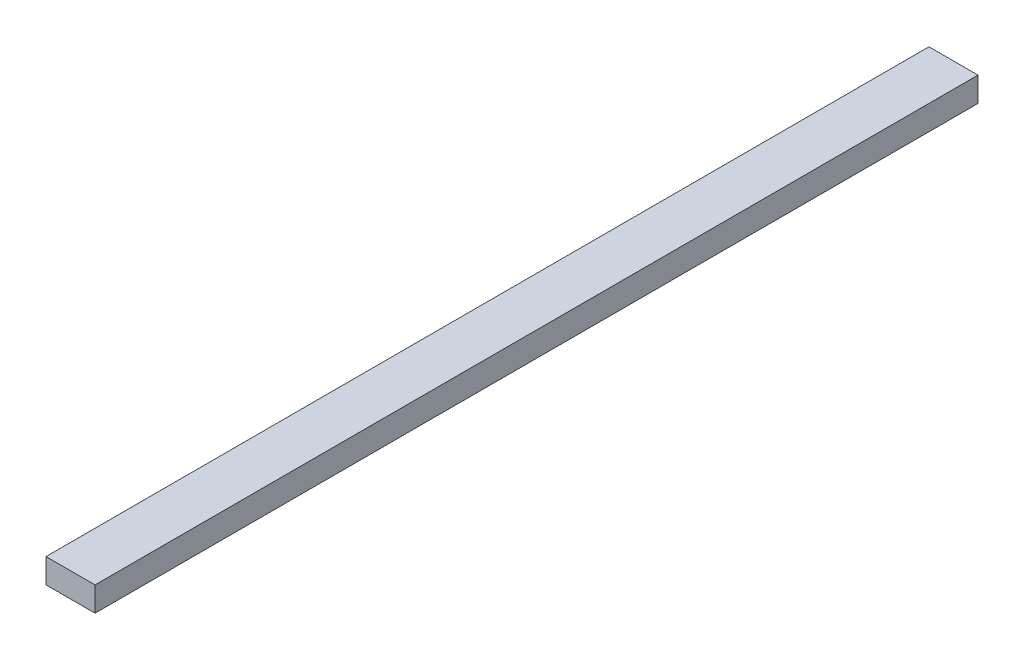
ISO-10303-21;
HEADER;
FILE_DESCRIPTION(('STEP AP214'),'2;1');
FILE_NAME('part.step','',(''),(''),'','','');
FILE_SCHEMA(('AUTOMOTIVE_DESIGN { 1 0 10303 214 1 1 1 1 }'));
ENDSEC;
DATA;
#1=APPLICATION_CONTEXT('core data for automotive mechanical design processes');
#2=APPLICATION_PROTOCOL_DEFINITION('international standard','automotive_design',2000,#1);
#3=PRODUCT_CONTEXT('',#1,'mechanical');
#4=PRODUCT('Part','Part','',(#3));
#5=PRODUCT_RELATED_PRODUCT_CATEGORY('part','',(#4));
#6=PRODUCT_DEFINITION_FORMATION('','',#4);
#7=PRODUCT_DEFINITION_CONTEXT('part definition',#1,'design');
#8=PRODUCT_DEFINITION('design','',#6,#7);
#9=PRODUCT_DEFINITION_SHAPE('','',#8);
#10=(LENGTH_UNIT() NAMED_UNIT(*) SI_UNIT(.MILLI.,.METRE.));
#11=(NAMED_UNIT(*) PLANE_ANGLE_UNIT() SI_UNIT($,.RADIAN.));
#12=(NAMED_UNIT(*) SI_UNIT($,.STERADIAN.) SOLID_ANGLE_UNIT());
#13=UNCERTAINTY_MEASURE_WITH_UNIT(LENGTH_MEASURE(1.E-05),#10,'distance_accuracy_value','');
#14=(GEOMETRIC_REPRESENTATION_CONTEXT(3) GLOBAL_UNCERTAINTY_ASSIGNED_CONTEXT((#13)) GLOBAL_UNIT_ASSIGNED_CONTEXT((#10,
#11,#12)) REPRESENTATION_CONTEXT('',''));
#15=CARTESIAN_POINT('',(0.,0.,0.));
#16=DIRECTION('',(0.,0.,1.));
#17=DIRECTION('',(1.,0.,0.));
#18=AXIS2_PLACEMENT_3D('',#15,#16,#17);
#19=CARTESIAN_POINT('',(25.4,-12.7,914.4));
#20=DIRECTION('',(-1.,0.,0.));
#21=DIRECTION('',(0.,0.,1.));
#22=AXIS2_PLACEMENT_3D('',#19,#20,#21);
#23=PLANE('',#22);
#24=DIRECTION('',(0.,1.,0.));
#25=VECTOR('',#24,1.);
#26=CARTESIAN_POINT('',(25.4,-12.7,0.));
#27=LINE('',#26,#25);
#28=CARTESIAN_POINT('',(25.4,-12.7,0.));
#29=VERTEX_POINT('',#28);
#30=CARTESIAN_POINT('',(25.4,12.7,0.));
#31=VERTEX_POINT('',#30);
#32=EDGE_CURVE('E113',#29,#31,#27,.T.);
#33=ORIENTED_EDGE('',*,*,#32,.T.);
#34=DIRECTION('',(0.,0.,-1.));
#35=VECTOR('',#34,1.);
#36=CARTESIAN_POINT('',(25.4,12.7,914.4));
#37=LINE('',#36,#35);
#38=CARTESIAN_POINT('',(25.4,12.7,914.4));
#39=VERTEX_POINT('',#38);
#40=EDGE_CURVE('E11',#39,#31,#37,.T.);
#41=ORIENTED_EDGE('',*,*,#40,.F.);
#42=DIRECTION('',(0.,1.,0.));
#43=VECTOR('',#42,1.);
#44=CARTESIAN_POINT('',(25.4,-12.7,914.4));
#45=LINE('',#44,#43);
#46=CARTESIAN_POINT('',(25.4,-12.7,914.4));
#47=VERTEX_POINT('',#46);
#48=EDGE_CURVE('E97',#47,#39,#45,.T.);
#49=ORIENTED_EDGE('',*,*,#48,.F.);
#50=DIRECTION('',(0.,0.,-1.));
#51=VECTOR('',#50,1.);
#52=CARTESIAN_POINT('',(25.4,-12.7,914.4));
#53=LINE('',#52,#51);
#54=EDGE_CURVE('E109',#47,#29,#53,.T.);
#55=ORIENTED_EDGE('',*,*,#54,.T.);
#56=EDGE_LOOP('',(#33,#41,#49,#55));
#57=FACE_BOUND('',#56,.T.);
#58=ADVANCED_FACE('F45',(#57),#23,.F.);
#59=CARTESIAN_POINT('',(-25.4,12.7,914.4));
#60=DIRECTION('',(0.,-1.,0.));
#61=DIRECTION('',(0.,0.,-1.));
#62=AXIS2_PLACEMENT_3D('',#59,#60,#61);
#63=PLANE('',#62);
#64=DIRECTION('',(-1.,0.,0.));
#65=VECTOR('',#64,1.);
#66=CARTESIAN_POINT('',(-25.4,12.7,0.));
#67=LINE('',#66,#65);
#68=CARTESIAN_POINT('',(-25.4,12.7,0.));
#69=VERTEX_POINT('',#68);
#70=EDGE_CURVE('E102',#31,#69,#67,.T.);
#71=ORIENTED_EDGE('',*,*,#70,.T.);
#72=DIRECTION('',(0.,0.,-1.));
#73=VECTOR('',#72,1.);
#74=CARTESIAN_POINT('',(-25.4,12.7,914.4));
#75=LINE('',#74,#73);
#76=CARTESIAN_POINT('',(-25.4,12.7,914.4));
#77=VERTEX_POINT('',#76);
#78=EDGE_CURVE('E54',#77,#69,#75,.T.);
#79=ORIENTED_EDGE('',*,*,#78,.F.);
#80=DIRECTION('',(-1.,0.,0.));
#81=VECTOR('',#80,1.);
#82=CARTESIAN_POINT('',(-25.4,12.7,914.4));
#83=LINE('',#82,#81);
#84=EDGE_CURVE('E92',#39,#77,#83,.T.);
#85=ORIENTED_EDGE('',*,*,#84,.F.);
#86=ORIENTED_EDGE('',*,*,#40,.T.);
#87=EDGE_LOOP('',(#71,#79,#85,#86));
#88=FACE_BOUND('',#87,.T.);
#89=ADVANCED_FACE('F101',(#88),#63,.F.);
#90=CARTESIAN_POINT('',(-25.4,-12.7,914.4));
#91=DIRECTION('',(1.,0.,0.));
#92=DIRECTION('',(0.,0.,-1.));
#93=AXIS2_PLACEMENT_3D('',#90,#91,#92);
#94=PLANE('',#93);
#95=DIRECTION('',(0.,-1.,0.));
#96=VECTOR('',#95,1.);
#97=CARTESIAN_POINT('',(-25.4,-12.7,0.));
#98=LINE('',#97,#96);
#99=CARTESIAN_POINT('',(-25.4,-12.7,0.));
#100=VERTEX_POINT('',#99);
#101=EDGE_CURVE('E79',#69,#100,#98,.T.);
#102=ORIENTED_EDGE('',*,*,#101,.T.);
#103=DIRECTION('',(0.,0.,-1.));
#104=VECTOR('',#103,1.);
#105=CARTESIAN_POINT('',(-25.4,-12.7,914.4));
#106=LINE('',#105,#104);
#107=CARTESIAN_POINT('',(-25.4,-12.7,914.4));
#108=VERTEX_POINT('',#107);
#109=EDGE_CURVE('E104',#108,#100,#106,.T.);
#110=ORIENTED_EDGE('',*,*,#109,.F.);
#111=DIRECTION('',(0.,-1.,0.));
#112=VECTOR('',#111,1.);
#113=CARTESIAN_POINT('',(-25.4,-12.7,914.4));
#114=LINE('',#113,#112);
#115=EDGE_CURVE('E95',#77,#108,#114,.T.);
#116=ORIENTED_EDGE('',*,*,#115,.F.);
#117=ORIENTED_EDGE('',*,*,#78,.T.);
#118=EDGE_LOOP('',(#102,#110,#116,#117));
#119=FACE_BOUND('',#118,.T.);
#120=ADVANCED_FACE('F105',(#119),#94,.F.);
#121=CARTESIAN_POINT('',(-25.4,-12.7,914.4));
#122=DIRECTION('',(0.,1.,0.));
#123=DIRECTION('',(0.,0.,1.));
#124=AXIS2_PLACEMENT_3D('',#121,#122,#123);
#125=PLANE('',#124);
#126=DIRECTION('',(1.,0.,0.));
#127=VECTOR('',#126,1.);
#128=CARTESIAN_POINT('',(-25.4,-12.7,0.));
#129=LINE('',#128,#127);
#130=EDGE_CURVE('E85',#100,#29,#129,.T.);
#131=ORIENTED_EDGE('',*,*,#130,.T.);
#132=ORIENTED_EDGE('',*,*,#54,.F.);
#133=DIRECTION('',(1.,0.,0.));
#134=VECTOR('',#133,1.);
#135=CARTESIAN_POINT('',(-25.4,-12.7,914.4));
#136=LINE('',#135,#134);
#137=EDGE_CURVE('E62',#108,#47,#136,.T.);
#138=ORIENTED_EDGE('',*,*,#137,.F.);
#139=ORIENTED_EDGE('',*,*,#109,.T.);
#140=EDGE_LOOP('',(#131,#132,#138,#139));
#141=FACE_BOUND('',#140,.T.);
#142=ADVANCED_FACE('F126',(#141),#125,.F.);
#143=CARTESIAN_POINT('',(0.,0.,914.4));
#144=DIRECTION('',(0.,0.,-1.));
#145=DIRECTION('',(-1.,0.,0.));
#146=AXIS2_PLACEMENT_3D('',#143,#144,#145);
#147=PLANE('',#146);
#148=ORIENTED_EDGE('',*,*,#48,.T.);
#149=ORIENTED_EDGE('',*,*,#84,.T.);
#150=ORIENTED_EDGE('',*,*,#115,.T.);
#151=ORIENTED_EDGE('',*,*,#137,.T.);
#152=EDGE_LOOP('',(#148,#149,#150,#151));
#153=FACE_BOUND('',#152,.T.);
#154=ADVANCED_FACE('F93',(#153),#147,.F.);
#155=CARTESIAN_POINT('',(0.,0.,0.));
#156=DIRECTION('',(0.,0.,-1.));
#157=DIRECTION('',(-1.,0.,0.));
#158=AXIS2_PLACEMENT_3D('',#155,#156,#157);
#159=PLANE('',#158);
#160=ORIENTED_EDGE('',*,*,#32,.F.);
#161=ORIENTED_EDGE('',*,*,#130,.F.);
#162=ORIENTED_EDGE('',*,*,#101,.F.);
#163=ORIENTED_EDGE('',*,*,#70,.F.);
#164=EDGE_LOOP('',(#160,#161,#162,#163));
#165=FACE_BOUND('',#164,.T.);
#166=ADVANCED_FACE('F129',(#165),#159,.T.);
#167=CLOSED_SHELL('',(#58,#89,#120,#142,#154,#166));
#168=MANIFOLD_SOLID_BREP('B2',#167);
#169=ADVANCED_BREP_SHAPE_REPRESENTATION('',(#18,#168),#14);
#170=SHAPE_DEFINITION_REPRESENTATION(#9,#169);
ENDSEC;
END-ISO-10303-21;
